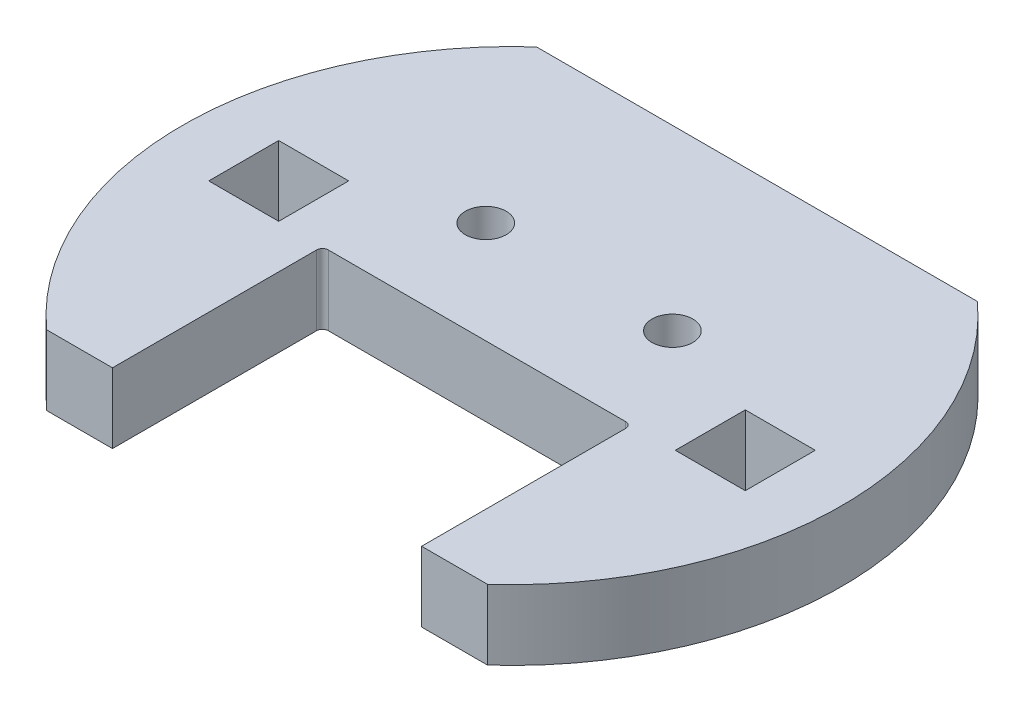
ISO-10303-21;
HEADER;
FILE_DESCRIPTION(('STEP AP214'),'2;1');
FILE_NAME('part.step','',(''),(''),'','','');
FILE_SCHEMA(('AUTOMOTIVE_DESIGN { 1 0 10303 214 1 1 1 1 }'));
ENDSEC;
DATA;
#1=APPLICATION_CONTEXT('core data for automotive mechanical design processes');
#2=APPLICATION_PROTOCOL_DEFINITION('international standard','automotive_design',2000,#1);
#3=PRODUCT_CONTEXT('',#1,'mechanical');
#4=PRODUCT('Part','Part','',(#3));
#5=PRODUCT_RELATED_PRODUCT_CATEGORY('part','',(#4));
#6=PRODUCT_DEFINITION_FORMATION('','',#4);
#7=PRODUCT_DEFINITION_CONTEXT('part definition',#1,'design');
#8=PRODUCT_DEFINITION('design','',#6,#7);
#9=PRODUCT_DEFINITION_SHAPE('','',#8);
#10=(LENGTH_UNIT() NAMED_UNIT(*) SI_UNIT(.MILLI.,.METRE.));
#11=(NAMED_UNIT(*) PLANE_ANGLE_UNIT() SI_UNIT($,.RADIAN.));
#12=(NAMED_UNIT(*) SI_UNIT($,.STERADIAN.) SOLID_ANGLE_UNIT());
#13=UNCERTAINTY_MEASURE_WITH_UNIT(LENGTH_MEASURE(1.E-05),#10,'distance_accuracy_value','');
#14=(GEOMETRIC_REPRESENTATION_CONTEXT(3) GLOBAL_UNCERTAINTY_ASSIGNED_CONTEXT((#13)) GLOBAL_UNIT_ASSIGNED_CONTEXT((#10,
#11,#12)) REPRESENTATION_CONTEXT('',''));
#15=CARTESIAN_POINT('',(0.,0.,0.));
#16=DIRECTION('',(0.,0.,1.));
#17=DIRECTION('',(1.,0.,0.));
#18=AXIS2_PLACEMENT_3D('',#15,#16,#17);
#19=CARTESIAN_POINT('',(23.,6.,3.00000000000001));
#20=DIRECTION('',(1.,0.,0.));
#21=DIRECTION('',(0.,0.,-1.));
#22=AXIS2_PLACEMENT_3D('',#19,#20,#21);
#23=PLANE('',#22);
#24=DIRECTION('',(0.,0.,1.));
#25=VECTOR('',#24,1.);
#26=CARTESIAN_POINT('',(23.,-12.,3.00000000000001));
#27=LINE('',#26,#25);
#28=CARTESIAN_POINT('',(23.,-12.,-2.99999999999999));
#29=VERTEX_POINT('',#28);
#30=CARTESIAN_POINT('',(23.,-12.,3.00000000000001));
#31=VERTEX_POINT('',#30);
#32=EDGE_CURVE('E52',#29,#31,#27,.T.);
#33=ORIENTED_EDGE('',*,*,#32,.F.);
#34=DIRECTION('',(0.,-1.,0.));
#35=VECTOR('',#34,1.);
#36=CARTESIAN_POINT('',(23.,6.,-2.99999999999999));
#37=LINE('',#36,#35);
#38=CARTESIAN_POINT('',(23.,-18.,-2.99999999999999));
#39=VERTEX_POINT('',#38);
#40=EDGE_CURVE('E288',#29,#39,#37,.T.);
#41=ORIENTED_EDGE('',*,*,#40,.T.);
#42=DIRECTION('',(0.,0.,1.));
#43=VECTOR('',#42,1.);
#44=CARTESIAN_POINT('',(23.,-18.,3.00000000000001));
#45=LINE('',#44,#43);
#46=CARTESIAN_POINT('',(23.,-18.,3.00000000000001));
#47=VERTEX_POINT('',#46);
#48=EDGE_CURVE('E299',#39,#47,#45,.T.);
#49=ORIENTED_EDGE('',*,*,#48,.T.);
#50=DIRECTION('',(0.,-1.,0.));
#51=VECTOR('',#50,1.);
#52=CARTESIAN_POINT('',(23.,6.,3.00000000000001));
#53=LINE('',#52,#51);
#54=EDGE_CURVE('E281',#31,#47,#53,.T.);
#55=ORIENTED_EDGE('',*,*,#54,.F.);
#56=EDGE_LOOP('',(#33,#41,#49,#55));
#57=FACE_BOUND('',#56,.T.);
#58=ADVANCED_FACE('F37',(#57),#23,.F.);
#59=CARTESIAN_POINT('',(23.,6.,-2.99999999999999));
#60=DIRECTION('',(0.,0.,-1.));
#61=DIRECTION('',(-1.,0.,0.));
#62=AXIS2_PLACEMENT_3D('',#59,#60,#61);
#63=PLANE('',#62);
#64=DIRECTION('',(1.,0.,0.));
#65=VECTOR('',#64,1.);
#66=CARTESIAN_POINT('',(23.,-12.,-2.99999999999999));
#67=LINE('',#66,#65);
#68=CARTESIAN_POINT('',(17.,-12.,-2.99999999999999));
#69=VERTEX_POINT('',#68);
#70=EDGE_CURVE('E321',#69,#29,#67,.T.);
#71=ORIENTED_EDGE('',*,*,#70,.F.);
#72=DIRECTION('',(0.,-1.,0.));
#73=VECTOR('',#72,1.);
#74=CARTESIAN_POINT('',(17.,6.,-2.99999999999999));
#75=LINE('',#74,#73);
#76=CARTESIAN_POINT('',(17.,-18.,-2.99999999999999));
#77=VERTEX_POINT('',#76);
#78=EDGE_CURVE('E286',#69,#77,#75,.T.);
#79=ORIENTED_EDGE('',*,*,#78,.T.);
#80=DIRECTION('',(1.,0.,0.));
#81=VECTOR('',#80,1.);
#82=CARTESIAN_POINT('',(23.,-18.,-2.99999999999999));
#83=LINE('',#82,#81);
#84=EDGE_CURVE('E284',#77,#39,#83,.T.);
#85=ORIENTED_EDGE('',*,*,#84,.T.);
#86=ORIENTED_EDGE('',*,*,#40,.F.);
#87=EDGE_LOOP('',(#71,#79,#85,#86));
#88=FACE_BOUND('',#87,.T.);
#89=ADVANCED_FACE('F350',(#88),#63,.F.);
#90=CARTESIAN_POINT('',(17.,6.,3.00000000000001));
#91=DIRECTION('',(-1.,0.,0.));
#92=DIRECTION('',(0.,0.,1.));
#93=AXIS2_PLACEMENT_3D('',#90,#91,#92);
#94=PLANE('',#93);
#95=DIRECTION('',(0.,0.,-1.));
#96=VECTOR('',#95,1.);
#97=CARTESIAN_POINT('',(17.,-12.,3.00000000000001));
#98=LINE('',#97,#96);
#99=CARTESIAN_POINT('',(17.,-12.,3.00000000000001));
#100=VERTEX_POINT('',#99);
#101=EDGE_CURVE('E323',#100,#69,#98,.T.);
#102=ORIENTED_EDGE('',*,*,#101,.F.);
#103=DIRECTION('',(0.,-1.,0.));
#104=VECTOR('',#103,1.);
#105=CARTESIAN_POINT('',(17.,6.,3.00000000000001));
#106=LINE('',#105,#104);
#107=CARTESIAN_POINT('',(17.,-18.,3.00000000000001));
#108=VERTEX_POINT('',#107);
#109=EDGE_CURVE('E283',#100,#108,#106,.T.);
#110=ORIENTED_EDGE('',*,*,#109,.T.);
#111=DIRECTION('',(0.,0.,-1.));
#112=VECTOR('',#111,1.);
#113=CARTESIAN_POINT('',(17.,-18.,3.00000000000001));
#114=LINE('',#113,#112);
#115=EDGE_CURVE('E293',#108,#77,#114,.T.);
#116=ORIENTED_EDGE('',*,*,#115,.T.);
#117=ORIENTED_EDGE('',*,*,#78,.F.);
#118=EDGE_LOOP('',(#102,#110,#116,#117));
#119=FACE_BOUND('',#118,.T.);
#120=ADVANCED_FACE('F356',(#119),#94,.F.);
#121=CARTESIAN_POINT('',(23.,6.,3.00000000000001));
#122=DIRECTION('',(0.,0.,1.));
#123=DIRECTION('',(1.,0.,0.));
#124=AXIS2_PLACEMENT_3D('',#121,#122,#123);
#125=PLANE('',#124);
#126=DIRECTION('',(-1.,0.,0.));
#127=VECTOR('',#126,1.);
#128=CARTESIAN_POINT('',(23.,-12.,3.00000000000001));
#129=LINE('',#128,#127);
#130=EDGE_CURVE('E325',#31,#100,#129,.T.);
#131=ORIENTED_EDGE('',*,*,#130,.F.);
#132=ORIENTED_EDGE('',*,*,#54,.T.);
#133=DIRECTION('',(-1.,0.,0.));
#134=VECTOR('',#133,1.);
#135=CARTESIAN_POINT('',(23.,-18.,3.00000000000001));
#136=LINE('',#135,#134);
#137=EDGE_CURVE('E296',#47,#108,#136,.T.);
#138=ORIENTED_EDGE('',*,*,#137,.T.);
#139=ORIENTED_EDGE('',*,*,#109,.F.);
#140=EDGE_LOOP('',(#131,#132,#138,#139));
#141=FACE_BOUND('',#140,.T.);
#142=ADVANCED_FACE('F361',(#141),#125,.F.);
#143=CARTESIAN_POINT('',(-17.,6.,3.));
#144=DIRECTION('',(1.,0.,0.));
#145=DIRECTION('',(0.,0.,-1.));
#146=AXIS2_PLACEMENT_3D('',#143,#144,#145);
#147=PLANE('',#146);
#148=DIRECTION('',(0.,0.,1.));
#149=VECTOR('',#148,1.);
#150=CARTESIAN_POINT('',(-17.,-12.,3.));
#151=LINE('',#150,#149);
#152=CARTESIAN_POINT('',(-17.,-12.,-3.));
#153=VERTEX_POINT('',#152);
#154=CARTESIAN_POINT('',(-17.,-12.,3.));
#155=VERTEX_POINT('',#154);
#156=EDGE_CURVE('E60',#153,#155,#151,.T.);
#157=ORIENTED_EDGE('',*,*,#156,.F.);
#158=DIRECTION('',(0.,-1.,0.));
#159=VECTOR('',#158,1.);
#160=CARTESIAN_POINT('',(-17.,6.,-3.));
#161=LINE('',#160,#159);
#162=CARTESIAN_POINT('',(-17.,-18.,-3.));
#163=VERTEX_POINT('',#162);
#164=EDGE_CURVE('E278',#153,#163,#161,.T.);
#165=ORIENTED_EDGE('',*,*,#164,.T.);
#166=DIRECTION('',(0.,0.,1.));
#167=VECTOR('',#166,1.);
#168=CARTESIAN_POINT('',(-17.,-18.,3.));
#169=LINE('',#168,#167);
#170=CARTESIAN_POINT('',(-17.,-18.,3.));
#171=VERTEX_POINT('',#170);
#172=EDGE_CURVE('E290',#163,#171,#169,.T.);
#173=ORIENTED_EDGE('',*,*,#172,.T.);
#174=DIRECTION('',(0.,-1.,0.));
#175=VECTOR('',#174,1.);
#176=CARTESIAN_POINT('',(-17.,6.,3.));
#177=LINE('',#176,#175);
#178=EDGE_CURVE('E302',#155,#171,#177,.T.);
#179=ORIENTED_EDGE('',*,*,#178,.F.);
#180=EDGE_LOOP('',(#157,#165,#173,#179));
#181=FACE_BOUND('',#180,.T.);
#182=ADVANCED_FACE('F507',(#181),#147,.F.);
#183=CARTESIAN_POINT('',(-23.,6.,-3.));
#184=DIRECTION('',(0.,0.,-1.));
#185=DIRECTION('',(-1.,0.,0.));
#186=AXIS2_PLACEMENT_3D('',#183,#184,#185);
#187=PLANE('',#186);
#188=DIRECTION('',(1.,0.,0.));
#189=VECTOR('',#188,1.);
#190=CARTESIAN_POINT('',(-23.,-12.,-3.));
#191=LINE('',#190,#189);
#192=CARTESIAN_POINT('',(-23.,-12.,-3.));
#193=VERTEX_POINT('',#192);
#194=EDGE_CURVE('E328',#193,#153,#191,.T.);
#195=ORIENTED_EDGE('',*,*,#194,.F.);
#196=DIRECTION('',(0.,-1.,0.));
#197=VECTOR('',#196,1.);
#198=CARTESIAN_POINT('',(-23.,6.,-3.));
#199=LINE('',#198,#197);
#200=CARTESIAN_POINT('',(-23.,-18.,-3.));
#201=VERTEX_POINT('',#200);
#202=EDGE_CURVE('E307',#193,#201,#199,.T.);
#203=ORIENTED_EDGE('',*,*,#202,.T.);
#204=DIRECTION('',(1.,0.,0.));
#205=VECTOR('',#204,1.);
#206=CARTESIAN_POINT('',(-23.,-18.,-3.));
#207=LINE('',#206,#205);
#208=EDGE_CURVE('E305',#201,#163,#207,.T.);
#209=ORIENTED_EDGE('',*,*,#208,.T.);
#210=ORIENTED_EDGE('',*,*,#164,.F.);
#211=EDGE_LOOP('',(#195,#203,#209,#210));
#212=FACE_BOUND('',#211,.T.);
#213=ADVANCED_FACE('F498',(#212),#187,.F.);
#214=CARTESIAN_POINT('',(-23.,6.,3.));
#215=DIRECTION('',(-1.,0.,0.));
#216=DIRECTION('',(0.,0.,1.));
#217=AXIS2_PLACEMENT_3D('',#214,#215,#216);
#218=PLANE('',#217);
#219=DIRECTION('',(0.,0.,-1.));
#220=VECTOR('',#219,1.);
#221=CARTESIAN_POINT('',(-23.,-12.,3.));
#222=LINE('',#221,#220);
#223=CARTESIAN_POINT('',(-23.,-12.,3.));
#224=VERTEX_POINT('',#223);
#225=EDGE_CURVE('E330',#224,#193,#222,.T.);
#226=ORIENTED_EDGE('',*,*,#225,.F.);
#227=DIRECTION('',(0.,-1.,0.));
#228=VECTOR('',#227,1.);
#229=CARTESIAN_POINT('',(-23.,6.,3.));
#230=LINE('',#229,#228);
#231=CARTESIAN_POINT('',(-23.,-18.,3.));
#232=VERTEX_POINT('',#231);
#233=EDGE_CURVE('E304',#224,#232,#230,.T.);
#234=ORIENTED_EDGE('',*,*,#233,.T.);
#235=DIRECTION('',(0.,0.,-1.));
#236=VECTOR('',#235,1.);
#237=CARTESIAN_POINT('',(-23.,-18.,3.));
#238=LINE('',#237,#236);
#239=EDGE_CURVE('E312',#232,#201,#238,.T.);
#240=ORIENTED_EDGE('',*,*,#239,.T.);
#241=ORIENTED_EDGE('',*,*,#202,.F.);
#242=EDGE_LOOP('',(#226,#234,#240,#241));
#243=FACE_BOUND('',#242,.T.);
#244=ADVANCED_FACE('F346',(#243),#218,.F.);
#245=CARTESIAN_POINT('',(-23.,6.,3.));
#246=DIRECTION('',(0.,0.,1.));
#247=DIRECTION('',(1.,0.,0.));
#248=AXIS2_PLACEMENT_3D('',#245,#246,#247);
#249=PLANE('',#248);
#250=DIRECTION('',(-1.,0.,0.));
#251=VECTOR('',#250,1.);
#252=CARTESIAN_POINT('',(-23.,-12.,3.));
#253=LINE('',#252,#251);
#254=EDGE_CURVE('E332',#155,#224,#253,.T.);
#255=ORIENTED_EDGE('',*,*,#254,.F.);
#256=ORIENTED_EDGE('',*,*,#178,.T.);
#257=DIRECTION('',(-1.,0.,0.));
#258=VECTOR('',#257,1.);
#259=CARTESIAN_POINT('',(-23.,-18.,3.));
#260=LINE('',#259,#258);
#261=EDGE_CURVE('E315',#171,#232,#260,.T.);
#262=ORIENTED_EDGE('',*,*,#261,.T.);
#263=ORIENTED_EDGE('',*,*,#233,.F.);
#264=EDGE_LOOP('',(#255,#256,#262,#263));
#265=FACE_BOUND('',#264,.T.);
#266=ADVANCED_FACE('F341',(#265),#249,.F.);
#267=CARTESIAN_POINT('',(-13.25,-12.,21.));
#268=DIRECTION('',(-1.,0.,0.));
#269=DIRECTION('',(0.,0.,1.));
#270=AXIS2_PLACEMENT_3D('',#267,#268,#269);
#271=PLANE('',#270);
#272=DIRECTION('',(0.,0.,-1.));
#273=VECTOR('',#272,1.);
#274=CARTESIAN_POINT('',(-13.25,-12.,21.));
#275=LINE('',#274,#273);
#276=CARTESIAN_POINT('',(-13.25,-12.,21.));
#277=VERTEX_POINT('',#276);
#278=CARTESIAN_POINT('',(-13.25,-12.,3.5));
#279=VERTEX_POINT('',#278);
#280=EDGE_CURVE('E334',#277,#279,#275,.T.);
#281=ORIENTED_EDGE('',*,*,#280,.F.);
#282=DIRECTION('',(0.,1.,0.));
#283=VECTOR('',#282,1.);
#284=CARTESIAN_POINT('',(-13.25,-12.,21.));
#285=LINE('',#284,#283);
#286=CARTESIAN_POINT('',(-13.25,-18.,21.));
#287=VERTEX_POINT('',#286);
#288=EDGE_CURVE('E11',#287,#277,#285,.T.);
#289=ORIENTED_EDGE('',*,*,#288,.F.);
#290=DIRECTION('',(0.,0.,1.));
#291=VECTOR('',#290,1.);
#292=CARTESIAN_POINT('',(-13.25,-18.,21.));
#293=LINE('',#292,#291);
#294=CARTESIAN_POINT('',(-13.25,-18.,3.5));
#295=VERTEX_POINT('',#294);
#296=EDGE_CURVE('E216',#295,#287,#293,.T.);
#297=ORIENTED_EDGE('',*,*,#296,.F.);
#298=DIRECTION('',(0.,1.,0.));
#299=VECTOR('',#298,1.);
#300=CARTESIAN_POINT('',(-13.25,-18.,3.5));
#301=LINE('',#300,#299);
#302=EDGE_CURVE('E217',#295,#279,#301,.T.);
#303=ORIENTED_EDGE('',*,*,#302,.T.);
#304=EDGE_LOOP('',(#281,#289,#297,#303));
#305=FACE_BOUND('',#304,.T.);
#306=ADVANCED_FACE('F39',(#305),#271,.F.);
#307=CARTESIAN_POINT('',(-18.8960974806969,-12.,21.));
#308=DIRECTION('',(0.,0.,-1.));
#309=DIRECTION('',(-1.,0.,0.));
#310=AXIS2_PLACEMENT_3D('',#307,#308,#309);
#311=PLANE('',#310);
#312=DIRECTION('',(1.,0.,0.));
#313=VECTOR('',#312,1.);
#314=CARTESIAN_POINT('',(-18.8960974806969,-12.,21.));
#315=LINE('',#314,#313);
#316=CARTESIAN_POINT('',(-18.8960974806969,-12.,21.));
#317=VERTEX_POINT('',#316);
#318=EDGE_CURVE('E209',#317,#277,#315,.T.);
#319=ORIENTED_EDGE('',*,*,#318,.F.);
#320=DIRECTION('',(0.,1.,0.));
#321=VECTOR('',#320,1.);
#322=CARTESIAN_POINT('',(-18.8960974806969,-12.,21.));
#323=LINE('',#322,#321);
#324=CARTESIAN_POINT('',(-18.8960974806969,-18.,21.));
#325=VERTEX_POINT('',#324);
#326=EDGE_CURVE('E45',#325,#317,#323,.T.);
#327=ORIENTED_EDGE('',*,*,#326,.F.);
#328=DIRECTION('',(-1.,0.,0.));
#329=VECTOR('',#328,1.);
#330=CARTESIAN_POINT('',(-18.8960974806969,-18.,21.));
#331=LINE('',#330,#329);
#332=EDGE_CURVE('E208',#287,#325,#331,.T.);
#333=ORIENTED_EDGE('',*,*,#332,.F.);
#334=ORIENTED_EDGE('',*,*,#288,.T.);
#335=EDGE_LOOP('',(#319,#327,#333,#334));
#336=FACE_BOUND('',#335,.T.);
#337=ADVANCED_FACE('F207',(#336),#311,.F.);
#338=CARTESIAN_POINT('',(0.,-12.,0.));
#339=DIRECTION('',(0.,1.,0.));
#340=DIRECTION('',(0.,0.,1.));
#341=AXIS2_PLACEMENT_3D('',#338,#339,#340);
#342=CYLINDRICAL_SURFACE('',#341,28.25);
#343=CARTESIAN_POINT('',(0.,-12.,0.));
#344=DIRECTION('',(0.,1.,0.));
#345=DIRECTION('',(0.,0.,1.));
#346=AXIS2_PLACEMENT_3D('',#343,#344,#345);
#347=CIRCLE('',#346,28.25);
#348=CARTESIAN_POINT('',(-18.8960974806969,-12.,-21.));
#349=VERTEX_POINT('',#348);
#350=EDGE_CURVE('E181',#349,#317,#347,.T.);
#351=ORIENTED_EDGE('',*,*,#350,.F.);
#352=DIRECTION('',(0.,1.,0.));
#353=VECTOR('',#352,1.);
#354=CARTESIAN_POINT('',(-18.8960974806969,-12.,-21.));
#355=LINE('',#354,#353);
#356=CARTESIAN_POINT('',(-18.8960974806969,-18.,-21.));
#357=VERTEX_POINT('',#356);
#358=EDGE_CURVE('E189',#357,#349,#355,.T.);
#359=ORIENTED_EDGE('',*,*,#358,.F.);
#360=CARTESIAN_POINT('',(0.,-18.,0.));
#361=DIRECTION('',(0.,-1.,0.));
#362=DIRECTION('',(0.,0.,1.));
#363=AXIS2_PLACEMENT_3D('',#360,#361,#362);
#364=CIRCLE('',#363,28.25);
#365=EDGE_CURVE('E202',#325,#357,#364,.T.);
#366=ORIENTED_EDGE('',*,*,#365,.F.);
#367=ORIENTED_EDGE('',*,*,#326,.T.);
#368=EDGE_LOOP('',(#351,#359,#366,#367));
#369=FACE_BOUND('',#368,.T.);
#370=ADVANCED_FACE('F200',(#369),#342,.T.);
#371=CARTESIAN_POINT('',(18.8960974806969,-12.,-21.));
#372=DIRECTION('',(0.,0.,1.));
#373=DIRECTION('',(1.,0.,0.));
#374=AXIS2_PLACEMENT_3D('',#371,#372,#373);
#375=PLANE('',#374);
#376=DIRECTION('',(-1.,0.,0.));
#377=VECTOR('',#376,1.);
#378=CARTESIAN_POINT('',(18.8960974806969,-12.,-21.));
#379=LINE('',#378,#377);
#380=CARTESIAN_POINT('',(18.8960974806969,-12.,-21.));
#381=VERTEX_POINT('',#380);
#382=EDGE_CURVE('E172',#381,#349,#379,.T.);
#383=ORIENTED_EDGE('',*,*,#382,.F.);
#384=DIRECTION('',(0.,1.,0.));
#385=VECTOR('',#384,1.);
#386=CARTESIAN_POINT('',(18.8960974806969,-12.,-21.));
#387=LINE('',#386,#385);
#388=CARTESIAN_POINT('',(18.8960974806969,-18.,-21.));
#389=VERTEX_POINT('',#388);
#390=EDGE_CURVE('E180',#389,#381,#387,.T.);
#391=ORIENTED_EDGE('',*,*,#390,.F.);
#392=DIRECTION('',(1.,0.,0.));
#393=VECTOR('',#392,1.);
#394=CARTESIAN_POINT('',(18.8960974806969,-18.,-21.));
#395=LINE('',#394,#393);
#396=EDGE_CURVE('E266',#357,#389,#395,.T.);
#397=ORIENTED_EDGE('',*,*,#396,.F.);
#398=ORIENTED_EDGE('',*,*,#358,.T.);
#399=EDGE_LOOP('',(#383,#391,#397,#398));
#400=FACE_BOUND('',#399,.T.);
#401=ADVANCED_FACE('F389',(#400),#375,.F.);
#402=CARTESIAN_POINT('',(0.,-12.,0.));
#403=DIRECTION('',(0.,1.,0.));
#404=DIRECTION('',(0.,0.,1.));
#405=AXIS2_PLACEMENT_3D('',#402,#403,#404);
#406=CYLINDRICAL_SURFACE('',#405,28.25);
#407=CARTESIAN_POINT('',(18.8960974806969,-12.,21.));
#408=VERTEX_POINT('',#407);
#409=EDGE_CURVE('E165',#408,#381,#347,.T.);
#410=ORIENTED_EDGE('',*,*,#409,.F.);
#411=DIRECTION('',(0.,1.,0.));
#412=VECTOR('',#411,1.);
#413=CARTESIAN_POINT('',(18.8960974806969,-12.,21.));
#414=LINE('',#413,#412);
#415=CARTESIAN_POINT('',(18.8960974806969,-18.,21.));
#416=VERTEX_POINT('',#415);
#417=EDGE_CURVE('E178',#416,#408,#414,.T.);
#418=ORIENTED_EDGE('',*,*,#417,.F.);
#419=CARTESIAN_POINT('',(0.,-18.,0.));
#420=DIRECTION('',(0.,-1.,0.));
#421=DIRECTION('',(0.,0.,-1.));
#422=AXIS2_PLACEMENT_3D('',#419,#420,#421);
#423=CIRCLE('',#422,28.25);
#424=EDGE_CURVE('E264',#389,#416,#423,.T.);
#425=ORIENTED_EDGE('',*,*,#424,.F.);
#426=ORIENTED_EDGE('',*,*,#390,.T.);
#427=EDGE_LOOP('',(#410,#418,#425,#426));
#428=FACE_BOUND('',#427,.T.);
#429=ADVANCED_FACE('F176',(#428),#406,.T.);
#430=CARTESIAN_POINT('',(13.25,-12.,21.));
#431=DIRECTION('',(0.,0.,-1.));
#432=DIRECTION('',(-1.,0.,0.));
#433=AXIS2_PLACEMENT_3D('',#430,#431,#432);
#434=PLANE('',#433);
#435=DIRECTION('',(1.,0.,0.));
#436=VECTOR('',#435,1.);
#437=CARTESIAN_POINT('',(13.25,-12.,21.));
#438=LINE('',#437,#436);
#439=CARTESIAN_POINT('',(13.25,-12.,21.));
#440=VERTEX_POINT('',#439);
#441=EDGE_CURVE('E161',#440,#408,#438,.T.);
#442=ORIENTED_EDGE('',*,*,#441,.F.);
#443=DIRECTION('',(0.,1.,0.));
#444=VECTOR('',#443,1.);
#445=CARTESIAN_POINT('',(13.25,-12.,21.));
#446=LINE('',#445,#444);
#447=CARTESIAN_POINT('',(13.25,-18.,21.));
#448=VERTEX_POINT('',#447);
#449=EDGE_CURVE('E187',#448,#440,#446,.T.);
#450=ORIENTED_EDGE('',*,*,#449,.F.);
#451=DIRECTION('',(-1.,0.,0.));
#452=VECTOR('',#451,1.);
#453=CARTESIAN_POINT('',(13.25,-18.,21.));
#454=LINE('',#453,#452);
#455=EDGE_CURVE('E186',#416,#448,#454,.T.);
#456=ORIENTED_EDGE('',*,*,#455,.F.);
#457=ORIENTED_EDGE('',*,*,#417,.T.);
#458=EDGE_LOOP('',(#442,#450,#456,#457));
#459=FACE_BOUND('',#458,.T.);
#460=ADVANCED_FACE('F184',(#459),#434,.F.);
#461=CARTESIAN_POINT('',(13.25,-12.,-11.));
#462=DIRECTION('',(1.,0.,0.));
#463=DIRECTION('',(0.,0.,-1.));
#464=AXIS2_PLACEMENT_3D('',#461,#462,#463);
#465=PLANE('',#464);
#466=DIRECTION('',(0.,0.,1.));
#467=VECTOR('',#466,1.);
#468=CARTESIAN_POINT('',(13.25,-12.,-11.));
#469=LINE('',#468,#467);
#470=CARTESIAN_POINT('',(13.25,-12.,3.5));
#471=VERTEX_POINT('',#470);
#472=EDGE_CURVE('E168',#471,#440,#469,.T.);
#473=ORIENTED_EDGE('',*,*,#472,.F.);
#474=DIRECTION('',(0.,1.,0.));
#475=VECTOR('',#474,1.);
#476=CARTESIAN_POINT('',(13.25,-18.,3.5));
#477=LINE('',#476,#475);
#478=CARTESIAN_POINT('',(13.25,-18.,3.5));
#479=VERTEX_POINT('',#478);
#480=EDGE_CURVE('E191',#479,#471,#477,.T.);
#481=ORIENTED_EDGE('',*,*,#480,.F.);
#482=DIRECTION('',(0.,0.,-1.));
#483=VECTOR('',#482,1.);
#484=CARTESIAN_POINT('',(13.25,-18.,3.5));
#485=LINE('',#484,#483);
#486=EDGE_CURVE('E261',#448,#479,#485,.T.);
#487=ORIENTED_EDGE('',*,*,#486,.F.);
#488=ORIENTED_EDGE('',*,*,#449,.T.);
#489=EDGE_LOOP('',(#473,#481,#487,#488));
#490=FACE_BOUND('',#489,.T.);
#491=ADVANCED_FACE('F376',(#490),#465,.F.);
#492=CARTESIAN_POINT('',(0.,-12.,0.));
#493=DIRECTION('',(0.,1.,0.));
#494=DIRECTION('',(0.,0.,1.));
#495=AXIS2_PLACEMENT_3D('',#492,#493,#494);
#496=PLANE('',#495);
#497=ORIENTED_EDGE('',*,*,#280,.T.);
#498=CARTESIAN_POINT('',(-12.75,-12.,3.5));
#499=DIRECTION('',(0.,1.,0.));
#500=DIRECTION('',(0.,0.,-1.));
#501=AXIS2_PLACEMENT_3D('',#498,#499,#500);
#502=CIRCLE('',#501,0.5);
#503=CARTESIAN_POINT('',(-12.75,-12.,3.));
#504=VERTEX_POINT('',#503);
#505=EDGE_CURVE('E231',#504,#279,#502,.T.);
#506=ORIENTED_EDGE('',*,*,#505,.F.);
#507=DIRECTION('',(-1.,0.,0.));
#508=VECTOR('',#507,1.);
#509=CARTESIAN_POINT('',(-12.75,-12.,3.));
#510=LINE('',#509,#508);
#511=CARTESIAN_POINT('',(12.75,-12.,3.));
#512=VERTEX_POINT('',#511);
#513=EDGE_CURVE('E228',#512,#504,#510,.T.);
#514=ORIENTED_EDGE('',*,*,#513,.F.);
#515=CARTESIAN_POINT('',(12.75,-12.,3.5));
#516=DIRECTION('',(0.,1.,0.));
#517=DIRECTION('',(0.,0.,-1.));
#518=AXIS2_PLACEMENT_3D('',#515,#516,#517);
#519=CIRCLE('',#518,0.5);
#520=EDGE_CURVE('E226',#471,#512,#519,.T.);
#521=ORIENTED_EDGE('',*,*,#520,.F.);
#522=ORIENTED_EDGE('',*,*,#472,.T.);
#523=ORIENTED_EDGE('',*,*,#441,.T.);
#524=ORIENTED_EDGE('',*,*,#409,.T.);
#525=ORIENTED_EDGE('',*,*,#382,.T.);
#526=ORIENTED_EDGE('',*,*,#350,.T.);
#527=ORIENTED_EDGE('',*,*,#318,.T.);
#528=EDGE_LOOP('',(#497,#506,#514,#521,#522,#523,#524,#525,#526,#527));
#529=FACE_BOUND('',#528,.T.);
#530=CARTESIAN_POINT('',(-8.,-12.,-5.75));
#531=DIRECTION('',(0.,-1.,0.));
#532=DIRECTION('',(0.,0.,-1.));
#533=AXIS2_PLACEMENT_3D('',#530,#531,#532);
#534=CIRCLE('',#533,1.75);
#535=CARTESIAN_POINT('',(-8.,-12.,-7.5));
#536=VERTEX_POINT('',#535);
#537=EDGE_CURVE('E269',#536,#536,#534,.T.);
#538=ORIENTED_EDGE('',*,*,#537,.T.);
#539=EDGE_LOOP('',(#538));
#540=FACE_BOUND('',#539,.T.);
#541=CARTESIAN_POINT('',(8.,-12.,-5.75));
#542=DIRECTION('',(0.,-1.,0.));
#543=DIRECTION('',(0.,0.,-1.));
#544=AXIS2_PLACEMENT_3D('',#541,#542,#543);
#545=CIRCLE('',#544,1.75);
#546=CARTESIAN_POINT('',(8.,-12.,-7.5));
#547=VERTEX_POINT('',#546);
#548=EDGE_CURVE('E275',#547,#547,#545,.T.);
#549=ORIENTED_EDGE('',*,*,#548,.T.);
#550=EDGE_LOOP('',(#549));
#551=FACE_BOUND('',#550,.T.);
#552=ORIENTED_EDGE('',*,*,#156,.T.);
#553=ORIENTED_EDGE('',*,*,#254,.T.);
#554=ORIENTED_EDGE('',*,*,#225,.T.);
#555=ORIENTED_EDGE('',*,*,#194,.T.);
#556=EDGE_LOOP('',(#552,#553,#554,#555));
#557=FACE_BOUND('',#556,.T.);
#558=ORIENTED_EDGE('',*,*,#32,.T.);
#559=ORIENTED_EDGE('',*,*,#130,.T.);
#560=ORIENTED_EDGE('',*,*,#101,.T.);
#561=ORIENTED_EDGE('',*,*,#70,.T.);
#562=EDGE_LOOP('',(#558,#559,#560,#561));
#563=FACE_BOUND('',#562,.T.);
#564=ADVANCED_FACE('F163',(#529,#540,#551,#557,#563),#496,.T.);
#565=CARTESIAN_POINT('',(0.,-18.,0.));
#566=DIRECTION('',(0.,1.,0.));
#567=DIRECTION('',(0.,0.,1.));
#568=AXIS2_PLACEMENT_3D('',#565,#566,#567);
#569=PLANE('',#568);
#570=ORIENTED_EDGE('',*,*,#261,.F.);
#571=ORIENTED_EDGE('',*,*,#172,.F.);
#572=ORIENTED_EDGE('',*,*,#208,.F.);
#573=ORIENTED_EDGE('',*,*,#239,.F.);
#574=EDGE_LOOP('',(#570,#571,#572,#573));
#575=FACE_BOUND('',#574,.T.);
#576=ORIENTED_EDGE('',*,*,#137,.F.);
#577=ORIENTED_EDGE('',*,*,#48,.F.);
#578=ORIENTED_EDGE('',*,*,#84,.F.);
#579=ORIENTED_EDGE('',*,*,#115,.F.);
#580=EDGE_LOOP('',(#576,#577,#578,#579));
#581=FACE_BOUND('',#580,.T.);
#582=ORIENTED_EDGE('',*,*,#365,.T.);
#583=ORIENTED_EDGE('',*,*,#396,.T.);
#584=ORIENTED_EDGE('',*,*,#424,.T.);
#585=ORIENTED_EDGE('',*,*,#455,.T.);
#586=ORIENTED_EDGE('',*,*,#486,.T.);
#587=CARTESIAN_POINT('',(12.75,-18.,3.5));
#588=DIRECTION('',(0.,1.,0.));
#589=DIRECTION('',(0.,0.,-1.));
#590=AXIS2_PLACEMENT_3D('',#587,#588,#589);
#591=CIRCLE('',#590,0.5);
#592=CARTESIAN_POINT('',(12.75,-18.,3.));
#593=VERTEX_POINT('',#592);
#594=EDGE_CURVE('E244',#479,#593,#591,.T.);
#595=ORIENTED_EDGE('',*,*,#594,.T.);
#596=DIRECTION('',(-1.,0.,0.));
#597=VECTOR('',#596,1.);
#598=CARTESIAN_POINT('',(-12.75,-18.,3.));
#599=LINE('',#598,#597);
#600=CARTESIAN_POINT('',(-12.75,-18.,3.));
#601=VERTEX_POINT('',#600);
#602=EDGE_CURVE('E257',#593,#601,#599,.T.);
#603=ORIENTED_EDGE('',*,*,#602,.T.);
#604=CARTESIAN_POINT('',(-12.75,-18.,3.5));
#605=DIRECTION('',(0.,1.,0.));
#606=DIRECTION('',(0.,0.,-1.));
#607=AXIS2_PLACEMENT_3D('',#604,#605,#606);
#608=CIRCLE('',#607,0.5);
#609=EDGE_CURVE('E222',#601,#295,#608,.T.);
#610=ORIENTED_EDGE('',*,*,#609,.T.);
#611=ORIENTED_EDGE('',*,*,#296,.T.);
#612=ORIENTED_EDGE('',*,*,#332,.T.);
#613=EDGE_LOOP('',(#582,#583,#584,#585,#586,#595,#603,#610,#611,#612));
#614=FACE_BOUND('',#613,.T.);
#615=CARTESIAN_POINT('',(-8.,-18.,-5.75));
#616=DIRECTION('',(0.,-1.,0.));
#617=DIRECTION('',(0.,0.,-1.));
#618=AXIS2_PLACEMENT_3D('',#615,#616,#617);
#619=CIRCLE('',#618,1.75);
#620=CARTESIAN_POINT('',(-8.,-18.,-7.5));
#621=VERTEX_POINT('',#620);
#622=EDGE_CURVE('E229',#621,#621,#619,.T.);
#623=ORIENTED_EDGE('',*,*,#622,.F.);
#624=EDGE_LOOP('',(#623));
#625=FACE_BOUND('',#624,.T.);
#626=CARTESIAN_POINT('',(8.,-18.,-5.75));
#627=DIRECTION('',(0.,-1.,0.));
#628=DIRECTION('',(0.,0.,-1.));
#629=AXIS2_PLACEMENT_3D('',#626,#627,#628);
#630=CIRCLE('',#629,1.75);
#631=CARTESIAN_POINT('',(8.,-18.,-7.5));
#632=VERTEX_POINT('',#631);
#633=EDGE_CURVE('E272',#632,#632,#630,.T.);
#634=ORIENTED_EDGE('',*,*,#633,.F.);
#635=EDGE_LOOP('',(#634));
#636=FACE_BOUND('',#635,.T.);
#637=ADVANCED_FACE('F212',(#575,#581,#614,#625,#636),#569,.F.);
#638=CARTESIAN_POINT('',(12.75,-18.,3.5));
#639=DIRECTION('',(0.,1.,0.));
#640=DIRECTION('',(0.,0.,1.));
#641=AXIS2_PLACEMENT_3D('',#638,#639,#640);
#642=CYLINDRICAL_SURFACE('',#641,0.5);
#643=ORIENTED_EDGE('',*,*,#520,.T.);
#644=DIRECTION('',(0.,1.,0.));
#645=VECTOR('',#644,1.);
#646=CARTESIAN_POINT('',(12.75,-18.,3.));
#647=LINE('',#646,#645);
#648=EDGE_CURVE('E236',#593,#512,#647,.T.);
#649=ORIENTED_EDGE('',*,*,#648,.F.);
#650=ORIENTED_EDGE('',*,*,#594,.F.);
#651=ORIENTED_EDGE('',*,*,#480,.T.);
#652=EDGE_LOOP('',(#643,#649,#650,#651));
#653=FACE_BOUND('',#652,.T.);
#654=ADVANCED_FACE('F242',(#653),#642,.F.);
#655=CARTESIAN_POINT('',(-12.75,-18.,3.));
#656=DIRECTION('',(0.,0.,-1.));
#657=DIRECTION('',(-1.,0.,0.));
#658=AXIS2_PLACEMENT_3D('',#655,#656,#657);
#659=PLANE('',#658);
#660=ORIENTED_EDGE('',*,*,#513,.T.);
#661=DIRECTION('',(0.,1.,0.));
#662=VECTOR('',#661,1.);
#663=CARTESIAN_POINT('',(-12.75,-18.,3.));
#664=LINE('',#663,#662);
#665=EDGE_CURVE('E220',#601,#504,#664,.T.);
#666=ORIENTED_EDGE('',*,*,#665,.F.);
#667=ORIENTED_EDGE('',*,*,#602,.F.);
#668=ORIENTED_EDGE('',*,*,#648,.T.);
#669=EDGE_LOOP('',(#660,#666,#667,#668));
#670=FACE_BOUND('',#669,.T.);
#671=ADVANCED_FACE('F251',(#670),#659,.F.);
#672=CARTESIAN_POINT('',(-12.75,-18.,3.5));
#673=DIRECTION('',(0.,1.,0.));
#674=DIRECTION('',(0.,0.,1.));
#675=AXIS2_PLACEMENT_3D('',#672,#673,#674);
#676=CYLINDRICAL_SURFACE('',#675,0.5);
#677=ORIENTED_EDGE('',*,*,#505,.T.);
#678=ORIENTED_EDGE('',*,*,#302,.F.);
#679=ORIENTED_EDGE('',*,*,#609,.F.);
#680=ORIENTED_EDGE('',*,*,#665,.T.);
#681=EDGE_LOOP('',(#677,#678,#679,#680));
#682=FACE_BOUND('',#681,.T.);
#683=ADVANCED_FACE('F255',(#682),#676,.F.);
#684=CARTESIAN_POINT('',(-8.,-18.,-5.75));
#685=DIRECTION('',(0.,1.,0.));
#686=DIRECTION('',(0.,0.,1.));
#687=AXIS2_PLACEMENT_3D('',#684,#685,#686);
#688=CYLINDRICAL_SURFACE('',#687,1.75);
#689=ORIENTED_EDGE('',*,*,#622,.T.);
#690=EDGE_LOOP('',(#689));
#691=FACE_BOUND('',#690,.T.);
#692=ORIENTED_EDGE('',*,*,#537,.F.);
#693=EDGE_LOOP('',(#692));
#694=FACE_BOUND('',#693,.T.);
#695=ADVANCED_FACE('F366',(#691,#694),#688,.F.);
#696=CARTESIAN_POINT('',(8.,-18.,-5.75));
#697=DIRECTION('',(0.,1.,0.));
#698=DIRECTION('',(0.,0.,1.));
#699=AXIS2_PLACEMENT_3D('',#696,#697,#698);
#700=CYLINDRICAL_SURFACE('',#699,1.75);
#701=ORIENTED_EDGE('',*,*,#633,.T.);
#702=EDGE_LOOP('',(#701));
#703=FACE_BOUND('',#702,.T.);
#704=ORIENTED_EDGE('',*,*,#548,.F.);
#705=EDGE_LOOP('',(#704));
#706=FACE_BOUND('',#705,.T.);
#707=ADVANCED_FACE('F363',(#703,#706),#700,.F.);
#708=CLOSED_SHELL('',(#58,#89,#120,#142,#182,#213,#244,#266,#306,#337,#370,#401,#429,#460,#491,
#564,#637,#654,#671,#683,#695,#707));
#709=MANIFOLD_SOLID_BREP('B2',#708);
#710=ADVANCED_BREP_SHAPE_REPRESENTATION('',(#18,#709),#14);
#711=SHAPE_DEFINITION_REPRESENTATION(#9,#710);
ENDSEC;
END-ISO-10303-21;
